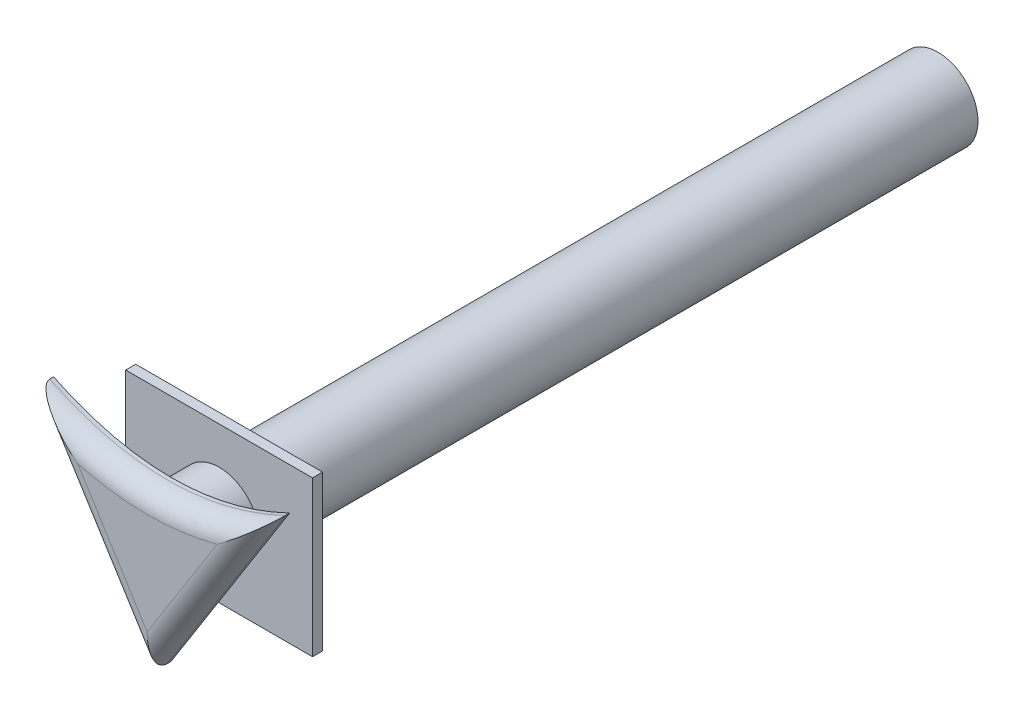
ISO-10303-21;
HEADER;
FILE_DESCRIPTION(('STEP AP214'),'2;1');
FILE_NAME('part.step','',(''),(''),'','','');
FILE_SCHEMA(('AUTOMOTIVE_DESIGN { 1 0 10303 214 1 1 1 1 }'));
ENDSEC;
DATA;
#1=APPLICATION_CONTEXT('core data for automotive mechanical design processes');
#2=APPLICATION_PROTOCOL_DEFINITION('international standard','automotive_design',2000,#1);
#3=PRODUCT_CONTEXT('',#1,'mechanical');
#4=PRODUCT('Part','Part','',(#3));
#5=PRODUCT_RELATED_PRODUCT_CATEGORY('part','',(#4));
#6=PRODUCT_DEFINITION_FORMATION('','',#4);
#7=PRODUCT_DEFINITION_CONTEXT('part definition',#1,'design');
#8=PRODUCT_DEFINITION('design','',#6,#7);
#9=PRODUCT_DEFINITION_SHAPE('','',#8);
#10=(LENGTH_UNIT() NAMED_UNIT(*) SI_UNIT(.MILLI.,.METRE.));
#11=(NAMED_UNIT(*) PLANE_ANGLE_UNIT() SI_UNIT($,.RADIAN.));
#12=(NAMED_UNIT(*) SI_UNIT($,.STERADIAN.) SOLID_ANGLE_UNIT());
#13=UNCERTAINTY_MEASURE_WITH_UNIT(LENGTH_MEASURE(1.E-05),#10,'distance_accuracy_value','');
#14=(GEOMETRIC_REPRESENTATION_CONTEXT(3) GLOBAL_UNCERTAINTY_ASSIGNED_CONTEXT((#13)) GLOBAL_UNIT_ASSIGNED_CONTEXT((#10,
#11,#12)) REPRESENTATION_CONTEXT('',''));
#15=CARTESIAN_POINT('',(0.,0.,0.));
#16=DIRECTION('',(0.,0.,1.));
#17=DIRECTION('',(1.,0.,0.));
#18=AXIS2_PLACEMENT_3D('',#15,#16,#17);
#19=CARTESIAN_POINT('',(30.2979017510264,43.0432393904696,0.3));
#20=DIRECTION('',(-0.847844868377494,-0.530244357976537,0.));
#21=DIRECTION('',(0.530244357976537,-0.847844868377494,0.));
#22=AXIS2_PLACEMENT_3D('',#19,#20,#21);
#23=PLANE('',#22);
#24=DIRECTION('',(0.,0.,1.));
#25=VECTOR('',#24,1.);
#26=CARTESIAN_POINT('',(36.1630126567419,33.6651024823239,0.3));
#27=LINE('',#26,#25);
#28=CARTESIAN_POINT('',(36.1630126567419,33.6651024823239,0.3));
#29=VERTEX_POINT('',#28);
#30=CARTESIAN_POINT('',(36.1630126567419,33.6651024823239,0.5));
#31=VERTEX_POINT('',#30);
#32=EDGE_CURVE('E158',#29,#31,#27,.T.);
#33=ORIENTED_EDGE('',*,*,#32,.T.);
#34=DIRECTION('',(0.530244357976537,-0.847844868377494,0.));
#35=VECTOR('',#34,1.);
#36=CARTESIAN_POINT('',(30.2979017510264,43.0432393904696,0.5));
#37=LINE('',#36,#35);
#38=CARTESIAN_POINT('',(30.2979017496192,43.0432393910986,0.5));
#39=VERTEX_POINT('',#38);
#40=EDGE_CURVE('E287',#31,#39,#37,.F.);
#41=ORIENTED_EDGE('',*,*,#40,.T.);
#42=DIRECTION('',(0.,0.,1.));
#43=VECTOR('',#42,1.);
#44=CARTESIAN_POINT('',(30.2979017496192,43.0432393910986,0.3));
#45=LINE('',#44,#43);
#46=CARTESIAN_POINT('',(30.2979017496192,43.0432393910986,0.3));
#47=VERTEX_POINT('',#46);
#48=EDGE_CURVE('E159',#47,#39,#45,.T.);
#49=ORIENTED_EDGE('',*,*,#48,.F.);
#50=DIRECTION('',(0.530244357976537,-0.847844868377494,0.));
#51=VECTOR('',#50,1.);
#52=CARTESIAN_POINT('',(30.2979017510264,43.0432393904696,0.3));
#53=LINE('',#52,#51);
#54=EDGE_CURVE('E145',#47,#29,#53,.T.);
#55=ORIENTED_EDGE('',*,*,#54,.T.);
#56=EDGE_LOOP('',(#33,#41,#49,#55));
#57=FACE_BOUND('',#56,.T.);
#58=ADVANCED_FACE('F32',(#57),#23,.T.);
#59=CARTESIAN_POINT('',(6066.28827286999,1000035.64074364,0.3));
#60=CARTESIAN_POINT('',(-1053.93647667072,-999957.785750634,0.3));
#61=CARTESIAN_POINT('',(-3813.71006353489,1000046.4110626,0.3));
#62=B_SPLINE_CURVE_WITH_KNOTS('',2,(#59,#60,#61),.UNSPECIFIED.,.F.,.F.,(3,3),(0.,1.),.UNSPECIFIED.);
#63=DIRECTION('',(0.,0.,1.));
#64=VECTOR('',#63,1.);
#65=SURFACE_OF_LINEAR_EXTRUSION('',#62,#64);
#66=ORIENTED_EDGE('',*,*,#48,.T.);
#67=CARTESIAN_POINT('',(45.7335735005879,45.3494086708565,0.5));
#68=CARTESIAN_POINT('',(45.7335735005768,45.3494086708707,1.5));
#69=CARTESIAN_POINT('',(46.3491799059495,44.561354895,1.5));
#70=CARTESIAN_POINT('',(45.7331086395795,45.349045539195,0.5));
#71=CARTESIAN_POINT('',(45.7331086395754,45.3490455392002,1.5));
#72=CARTESIAN_POINT('',(46.3488196658647,44.5610735077939,1.5));
#73=CARTESIAN_POINT('',(45.7327119327311,45.348735662061,0.5));
#74=CARTESIAN_POINT('',(45.7327119327301,45.3487356620624,1.5));
#75=CARTESIAN_POINT('',(46.3484594248833,44.560792121735,1.5));
#76=CARTESIAN_POINT('',(45.7319811215552,45.3481648402711,0.5));
#77=CARTESIAN_POINT('',(45.7319811215563,45.3481648402696,1.5));
#78=CARTESIAN_POINT('',(46.3477389340724,44.5602293609476,1.5));
#79=CARTESIAN_POINT('',(45.7316470172274,45.3479038956151,0.5));
#80=CARTESIAN_POINT('',(45.7316470172278,45.3479038956146,1.5));
#81=CARTESIAN_POINT('',(46.3473786842429,44.559947986219,1.5));
#82=CARTESIAN_POINT('',(45.7306280493234,45.3471080954971,0.5));
#83=CARTESIAN_POINT('',(45.7306280493225,45.3471080954983,1.5));
#84=CARTESIAN_POINT('',(46.3462979108972,44.5591038925802,1.5));
#85=CARTESIAN_POINT('',(45.7299265308262,45.3465602738852,0.5));
#86=CARTESIAN_POINT('',(45.7299265308258,45.3465602738857,1.5));
#87=CARTESIAN_POINT('',(46.3455773635234,44.5585412042167,1.5));
#88=CARTESIAN_POINT('',(45.7278336862121,45.3449261338302,0.5));
#89=CARTESIAN_POINT('',(45.7278336862124,45.3449261338299,1.5));
#90=CARTESIAN_POINT('',(46.3434156334423,44.5568532517864,1.5));
#91=CARTESIAN_POINT('',(45.7264540709661,45.3438491401631,0.5));
#92=CARTESIAN_POINT('',(45.7264540709655,45.3438491401638,1.5));
#93=CARTESIAN_POINT('',(46.3419743627689,44.5557281003746,1.5));
#94=CARTESIAN_POINT('',(45.7223065714428,45.3406121058281,0.5));
#95=CARTESIAN_POINT('',(45.7223065714438,45.3406121058268,1.5));
#96=CARTESIAN_POINT('',(46.3376501935769,44.552353103825,1.5));
#97=CARTESIAN_POINT('',(45.7195300333449,45.3384460117987,0.5));
#98=CARTESIAN_POINT('',(45.719530033352,45.3384460117896,1.5));
#99=CARTESIAN_POINT('',(46.3347669378493,44.5501037163438,1.5));
#100=CARTESIAN_POINT('',(45.7112051237383,45.3319542342932,0.5));
#101=CARTESIAN_POINT('',(45.711205123724,45.3319542343116,1.5));
#102=CARTESIAN_POINT('',(46.3261157453976,44.5433573825314,1.5));
#103=CARTESIAN_POINT('',(45.7056614564164,45.3276350550088,0.5));
#104=CARTESIAN_POINT('',(45.7056614563349,45.3276350551138,1.5));
#105=CARTESIAN_POINT('',(46.3203463828867,44.5388622644265,1.5));
#106=CARTESIAN_POINT('',(45.6890214123043,45.3146817913281,0.5));
#107=CARTESIAN_POINT('',(45.6890214124259,45.3146817911712,1.5));
#108=CARTESIAN_POINT('',(46.303032586957,44.5253842457298,1.5));
#109=CARTESIAN_POINT('',(45.6779159918359,45.3060519799072,0.5));
#110=CARTESIAN_POINT('',(45.6779159926327,45.3060519788805,1.5));
#111=CARTESIAN_POINT('',(46.2914824435459,44.5164086795096,1.5));
#112=CARTESIAN_POINT('',(45.6445833078567,45.280195226233,0.5));
#113=CARTESIAN_POINT('',(45.6445833094798,45.2801952241418,1.5));
#114=CARTESIAN_POINT('',(46.2568091702562,44.4895114976609,1.5));
#115=CARTESIAN_POINT('',(45.6223395843858,45.2630009353633,0.5));
#116=CARTESIAN_POINT('',(45.6223395849609,45.2630009346223,1.5));
#117=CARTESIAN_POINT('',(46.2336631584577,44.4716193684841,1.5));
#118=CARTESIAN_POINT('',(45.5555284179161,45.2115388847596,0.5));
#119=CARTESIAN_POINT('',(45.5555284167663,45.2115388862411,1.5));
#120=CARTESIAN_POINT('',(46.1641332800053,44.4180621158519,1.5));
#121=CARTESIAN_POINT('',(45.5108810113853,45.1773919724412,0.5));
#122=CARTESIAN_POINT('',(45.5108810109776,45.1773919729669,1.5));
#123=CARTESIAN_POINT('',(46.1176576041264,44.382516153726,1.5));
#124=CARTESIAN_POINT('',(45.3766300230627,45.0754535462892,0.5));
#125=CARTESIAN_POINT('',(45.3766300238781,45.0754535452379,1.5));
#126=CARTESIAN_POINT('',(45.9778634161705,44.2763666219551,1.5));
#127=CARTESIAN_POINT('',(45.2867150214892,45.0081622715448,0.5));
#128=CARTESIAN_POINT('',(45.2867150217829,45.0081622711627,1.5));
#129=CARTESIAN_POINT('',(45.8841749869004,44.2062492523865,1.5));
#130=CARTESIAN_POINT('',(45.0156853457064,44.8083431547999,0.5));
#131=CARTESIAN_POINT('',(45.0156853451199,44.808343155563,1.5));
#132=CARTESIAN_POINT('',(45.6015874931887,43.9979047657089,1.5));
#133=CARTESIAN_POINT('',(44.833311307029,44.6778898203783,0.5));
#134=CARTESIAN_POINT('',(44.8333113067696,44.6778898207543,1.5));
#135=CARTESIAN_POINT('',(45.4111925390576,43.861705864209,1.5));
#136=CARTESIAN_POINT('',(44.2805184153718,44.2950683525777,0.5));
#137=CARTESIAN_POINT('',(44.2805184158934,44.2950683518216,1.5));
#138=CARTESIAN_POINT('',(44.8332805985207,43.4614793439334,1.5));
#139=CARTESIAN_POINT('',(43.9049586346634,44.0516554081136,0.5));
#140=CARTESIAN_POINT('',(43.9049586354369,44.0516554066426,1.5));
#141=CARTESIAN_POINT('',(44.4395872728254,43.2062552861195,1.5));
#142=CARTESIAN_POINT('',(43.1345730125814,43.5891282150532,0.5));
#143=CARTESIAN_POINT('',(43.1345730126051,43.5891282151997,1.5));
#144=CARTESIAN_POINT('',(43.629481576213,42.7198699851167,1.5));
#145=CARTESIAN_POINT('',(42.7395428036684,43.3704327315915,0.5));
#146=CARTESIAN_POINT('',(42.7395428026717,43.3704327341162,1.5));
#147=CARTESIAN_POINT('',(43.2128171675268,42.4891266245356,1.5));
#148=CARTESIAN_POINT('',(41.9363161818128,42.9660449107167,0.5));
#149=CARTESIAN_POINT('',(41.9363161828066,42.9660449081982,1.5));
#150=CARTESIAN_POINT('',(42.3627461303794,42.061144940266,1.5));
#151=CARTESIAN_POINT('',(41.5281264595165,42.7803361051633,0.5));
#152=CARTESIAN_POINT('',(41.528126463519,42.7803360952283,1.5));
#153=CARTESIAN_POINT('',(41.9293479883117,41.8638899001863,1.5));
#154=CARTESIAN_POINT('',(40.7178576457224,42.4535518139551,0.5));
#155=CARTESIAN_POINT('',(40.717857649617,42.453551804317,1.5));
#156=CARTESIAN_POINT('',(41.0661620244384,41.5157561901519,1.5));
#157=CARTESIAN_POINT('',(40.316290749012,42.3108807737344,0.5));
#158=CARTESIAN_POINT('',(40.3162907500517,42.310880771163,1.5));
#159=CARTESIAN_POINT('',(40.6370437556781,41.3632278511785,1.5));
#160=CARTESIAN_POINT('',(39.5040297166957,42.0633373044249,0.5));
#161=CARTESIAN_POINT('',(39.5040297156429,42.0633373070392,1.5));
#162=CARTESIAN_POINT('',(39.766554159097,41.0979331402665,1.5));
#163=CARTESIAN_POINT('',(39.0933351531859,41.958466651399,0.5));
#164=CARTESIAN_POINT('',(39.0933351528955,41.9584666521319,1.5));
#165=CARTESIAN_POINT('',(39.3251822565845,40.9851686366494,1.5));
#166=CARTESIAN_POINT('',(38.2687423306789,41.7902676109707,0.5));
#167=CARTESIAN_POINT('',(38.2687423309478,41.7902676103375,1.5));
#168=CARTESIAN_POINT('',(38.4370379252583,40.8040029399922,1.5));
#169=CARTESIAN_POINT('',(37.8548960969657,41.7266131436139,0.5));
#170=CARTESIAN_POINT('',(37.8548960970392,41.7266131434769,1.5));
#171=CARTESIAN_POINT('',(37.9903370903083,40.7352535731856,1.5));
#172=CARTESIAN_POINT('',(37.023891067508,41.6415196539969,0.5));
#173=CARTESIAN_POINT('',(37.02389106743,41.6415196541787,1.5));
#174=CARTESIAN_POINT('',(37.0922829947754,40.6432933024116,1.5));
#175=CARTESIAN_POINT('',(36.606732849846,41.6200734204598,0.5));
#176=CARTESIAN_POINT('',(36.606732849812,41.6200734204645,1.5));
#177=CARTESIAN_POINT('',(36.6409305421697,40.6200746195294,1.5));
#178=CARTESIAN_POINT('',(35.8197293857221,41.6200650649362,0.5));
#179=CARTESIAN_POINT('',(35.8197293857523,41.6200650649173,1.5));
#180=CARTESIAN_POINT('',(35.7894048282363,40.6200640016286,1.5));
#181=CARTESIAN_POINT('',(35.4498755249821,41.636921948999,0.5));
#182=CARTESIAN_POINT('',(35.4498755250345,41.6369219490986,1.5));
#183=CARTESIAN_POINT('',(35.3892236052004,40.6383126489799,1.5));
#184=CARTESIAN_POINT('',(34.7125345666675,41.7039136249315,0.5));
#185=CARTESIAN_POINT('',(34.7125345666104,41.7039136247798,1.5));
#186=CARTESIAN_POINT('',(34.5921542668251,40.7107329421308,1.5));
#187=CARTESIAN_POINT('',(34.3450473635447,41.7540469222138,0.5));
#188=CARTESIAN_POINT('',(34.3450473633557,41.7540469216925,1.5));
#189=CARTESIAN_POINT('',(34.1952660043952,40.764902974546,1.5));
#190=CARTESIAN_POINT('',(33.6120148826078,41.8868388884535,0.5));
#191=CARTESIAN_POINT('',(33.6120148827965,41.8868388889688,1.5));
#192=CARTESIAN_POINT('',(33.4049436308872,40.9080762644321,1.5));
#193=CARTESIAN_POINT('',(33.2465020936867,41.9697267421534,0.5));
#194=CARTESIAN_POINT('',(33.2465020943894,41.9697267440876,1.5));
#195=CARTESIAN_POINT('',(33.0115542750572,40.9973249442197,1.5));
#196=CARTESIAN_POINT('',(32.522021798467,42.1660626895427,0.5));
#197=CARTESIAN_POINT('',(32.5220217977532,42.1660626875674,1.5));
#198=CARTESIAN_POINT('',(32.2336198307675,41.2081523362124,1.5));
#199=CARTESIAN_POINT('',(32.1630542852425,42.2795107508928,0.5));
#200=CARTESIAN_POINT('',(32.163054282598,42.279510743589,1.5));
#201=CARTESIAN_POINT('',(31.8490747329491,41.3297310142052,1.5));
#202=CARTESIAN_POINT('',(31.3454347711054,42.5732886988452,0.5));
#203=CARTESIAN_POINT('',(31.3454347679063,42.573288689876,1.5));
#204=CARTESIAN_POINT('',(30.9755237325729,41.643612215028,1.5));
#205=CARTESIAN_POINT('',(30.8895626815628,42.7634677778477,0.5));
#206=CARTESIAN_POINT('',(30.88956268092,42.7634677757579,1.5));
#207=CARTESIAN_POINT('',(30.4902013047443,41.8461813415862,1.5));
#208=CARTESIAN_POINT('',(29.9933192111917,43.185975468697,0.5));
#209=CARTESIAN_POINT('',(29.9933192118394,43.1859754707977,1.5));
#210=CARTESIAN_POINT('',(29.5394962065659,42.294373733884,1.5));
#211=CARTESIAN_POINT('',(29.5529642103806,43.4183471166328,0.5));
#212=CARTESIAN_POINT('',(29.5529642097585,43.4183471160345,1.5));
#213=CARTESIAN_POINT('',(29.074134500715,42.5400409506035,1.5));
#214=CARTESIAN_POINT('',(28.6949148686064,43.9158733213685,0.5));
#215=CARTESIAN_POINT('',(28.6949148683932,43.9158733205331,1.5));
#216=CARTESIAN_POINT('',(28.1704596110674,43.0640294158496,1.5));
#217=CARTESIAN_POINT('',(28.2770002642343,44.1805621010411,0.5));
#218=CARTESIAN_POINT('',(28.2770002656615,44.1805621026007,1.5));
#219=CARTESIAN_POINT('',(27.731873316164,43.3418843138641,1.5));
#220=CARTESIAN_POINT('',(27.4589207402657,44.739171406259,0.5));
#221=CARTESIAN_POINT('',(27.4589207388387,44.7391714046983,1.5));
#222=CARTESIAN_POINT('',(26.8759382148646,43.9263743654658,1.5));
#223=CARTESIAN_POINT('',(27.0587120601277,45.0330132814566,0.5));
#224=CARTESIAN_POINT('',(27.0587120542222,45.0330132744011,1.5));
#225=CARTESIAN_POINT('',(26.4585366246044,44.2329319643074,1.5));
#226=CARTESIAN_POINT('',(26.6668313159995,45.3392091757773,0.5));
#227=CARTESIAN_POINT('',(26.6668312980907,45.3392091528712,1.5));
#228=CARTESIAN_POINT('',(26.0509023544704,44.5514074415181,1.5));
#229=(BOUNDED_SURFACE() B_SPLINE_SURFACE(3,2,((#67,#68,#69),(#70,#71,#72),(#73,#74,#75),(#76,
#77,#78),(#79,#80,#81),(#82,#83,#84),(#85,#86,#87),(#88,#89,#90),(#91,#92,#93),(#94,#95,#96),
(#97,#98,#99),(#100,#101,#102),(#103,#104,#105),(#106,#107,#108),(#109,#110,#111),(#112,#113,
#114),(#115,#116,#117),(#118,#119,#120),(#121,#122,#123),(#124,#125,#126),(#127,#128,#129),
(#130,#131,#132),(#133,#134,#135),(#136,#137,#138),(#139,#140,#141),(#142,#143,#144),(#145,#146,
#147),(#148,#149,#150),(#151,#152,#153),(#154,#155,#156),(#157,#158,#159),(#160,#161,#162),
(#163,#164,#165),(#166,#167,#168),(#169,#170,#171),(#172,#173,#174),(#175,#176,#177),(#178,#179,
#180),(#181,#182,#183),(#184,#185,#186),(#187,#188,#189),(#190,#191,#192),(#193,#194,#195),
(#196,#197,#198),(#199,#200,#201),(#202,#203,#204),(#205,#206,#207),(#208,#209,#210),(#211,#212,
#213),(#214,#215,#216),(#217,#218,#219),(#220,#221,#222),(#223,#224,#225),(#226,#227,#228)),
.UNSPECIFIED.,.F.,.F.,.F.) B_SPLINE_SURFACE_WITH_KNOTS((4,2,2,2,2,2,2,2,2,2,2,2,2,2,2,2,2,2,2,2,
2,2,2,2,2,2,4),(3,3),(0.,0.00137133697820587,0.00274267395243674,0.00548534789970985,
0.0109706957695298,0.0219413913672367,0.0438827805899432,0.087765552962445,0.175530949758712,
0.351061872145982,0.702113221120698,1.40431612564923,2.81082102650417,4.23840199130549,
5.66526824068247,7.02979426272532,8.39438438909092,9.74804226853787,11.1014688554522,
12.3016402280318,13.5017576993861,14.7104254990754,15.9190920197325,17.4942700503849,
19.0710638691238,20.6273460272763,22.1795382110022),(0.,1.),
.UNSPECIFIED.) GEOMETRIC_REPRESENTATION_ITEM() RATIONAL_B_SPLINE_SURFACE(((1.,0.707106781186548,
1.),(1.,0.707106781186548,1.),(1.,0.707106781186548,1.),(1.,0.707106781186548,1.),(1.,
0.707106781186548,1.),(1.,0.707106781186548,1.),(1.,0.707106781186548,1.),(1.,0.707106781186548,
1.),(1.,0.707106781186548,1.),(1.,0.707106781186548,1.),(1.,0.707106781186548,1.),(1.,
0.707106781186548,1.),(1.,0.707106781186548,1.),(1.,0.707106781186548,1.),(1.,0.707106781186548,
1.),(1.,0.707106781186548,1.),(1.,0.707106781186548,1.),(1.,0.707106781186548,1.),(1.,
0.707106781186548,1.),(1.,0.707106781186548,1.),(1.,0.707106781186548,1.),(1.,0.707106781186548,
1.),(1.,0.707106781186548,1.),(1.,0.707106781186548,1.),(1.,0.707106781186548,1.),(1.,
0.707106781186548,1.),(1.,0.707106781186548,1.),(1.,0.707106781186548,1.),(1.,0.707106781186548,
1.),(1.,0.707106781186548,1.),(1.,0.707106781186548,1.),(1.,0.707106781186548,1.),(1.,
0.707106781186548,1.),(1.,0.707106781186548,1.),(1.,0.707106781186548,1.),(1.,0.707106781186548,
1.),(1.,0.707106781186548,1.),(1.,0.707106781186548,1.),(1.,0.707106781186548,1.),(1.,
0.707106781186548,1.),(1.,0.707106781186548,1.),(1.,0.707106781186548,1.),(1.,0.707106781186548,
1.),(1.,0.707106781186548,1.),(1.,0.707106781186548,1.),(1.,0.707106781186548,1.),(1.,
0.707106781186548,1.),(1.,0.707106781186548,1.),(1.,0.707106781186548,1.),(1.,0.707106781186548,
1.),(1.,0.707106781186548,1.),(1.,0.707106781186548,1.),(1.,0.707106781186548,1.),(1.,
0.707106781186548,1.))) REPRESENTATION_ITEM('') SURFACE());
#230=CARTESIAN_POINT('',(26.6668313159995,45.3392091757773,0.5));
#231=CARTESIAN_POINT('',(27.0587120601277,45.0330132814566,0.5));
#232=CARTESIAN_POINT('',(27.4589207402657,44.739171406259,0.5));
#233=CARTESIAN_POINT('',(28.2770002642343,44.1805621010411,0.5));
#234=CARTESIAN_POINT('',(28.6949148686064,43.9158733213685,0.5));
#235=CARTESIAN_POINT('',(29.5529642103806,43.4183471166328,0.5));
#236=CARTESIAN_POINT('',(29.9933192111917,43.185975468697,0.5));
#237=CARTESIAN_POINT('',(30.8895626815628,42.7634677778477,0.5));
#238=CARTESIAN_POINT('',(31.3454347711054,42.5732886988452,0.5));
#239=CARTESIAN_POINT('',(32.1630542852425,42.2795107508928,0.5));
#240=CARTESIAN_POINT('',(32.522021798467,42.1660626895427,0.5));
#241=CARTESIAN_POINT('',(33.2465020936867,41.9697267421533,0.5));
#242=CARTESIAN_POINT('',(33.6120148826078,41.8868388884535,0.5));
#243=CARTESIAN_POINT('',(34.3450473635447,41.7540469222138,0.5));
#244=CARTESIAN_POINT('',(34.7125345666675,41.7039136249315,0.5));
#245=CARTESIAN_POINT('',(35.4498755249821,41.636921948999,0.5));
#246=CARTESIAN_POINT('',(35.8197293857221,41.6200650649362,0.5));
#247=CARTESIAN_POINT('',(36.606732849846,41.6200734204598,0.5));
#248=CARTESIAN_POINT('',(37.023891067508,41.6415196539969,0.5));
#249=CARTESIAN_POINT('',(37.8548960969657,41.7266131436139,0.5));
#250=CARTESIAN_POINT('',(38.2687423306789,41.7902676109706,0.5));
#251=CARTESIAN_POINT('',(39.0933351531859,41.958466651399,0.5));
#252=CARTESIAN_POINT('',(39.5040297166957,42.0633373044249,0.5));
#253=CARTESIAN_POINT('',(40.316290749012,42.3108807737344,0.5));
#254=CARTESIAN_POINT('',(40.7178576457224,42.4535518139551,0.5));
#255=CARTESIAN_POINT('',(41.5281264595165,42.7803361051633,0.5));
#256=CARTESIAN_POINT('',(41.9363161818128,42.9660449107167,0.5));
#257=CARTESIAN_POINT('',(42.7395428036684,43.3704327315915,0.5));
#258=CARTESIAN_POINT('',(43.1345730125814,43.5891282150532,0.5));
#259=CARTESIAN_POINT('',(43.9049586346634,44.0516554081136,0.5));
#260=CARTESIAN_POINT('',(44.2805184153718,44.2950683525777,0.5));
#261=CARTESIAN_POINT('',(44.833311307029,44.6778898203783,0.5));
#262=CARTESIAN_POINT('',(45.0156853457064,44.8083431547999,0.5));
#263=CARTESIAN_POINT('',(45.2867150214892,45.0081622715448,0.5));
#264=CARTESIAN_POINT('',(45.3766300230627,45.0754535462892,0.5));
#265=CARTESIAN_POINT('',(45.5108810113853,45.1773919724412,0.5));
#266=CARTESIAN_POINT('',(45.5555284179161,45.2115388847596,0.5));
#267=CARTESIAN_POINT('',(45.6223395843858,45.2630009353633,0.5));
#268=CARTESIAN_POINT('',(45.6445833078567,45.280195226233,0.5));
#269=CARTESIAN_POINT('',(45.6779159918359,45.3060519799072,0.5));
#270=CARTESIAN_POINT('',(45.6890214123043,45.3146817913281,0.5));
#271=CARTESIAN_POINT('',(45.7056614564164,45.3276350550088,0.5));
#272=CARTESIAN_POINT('',(45.7112051237383,45.3319542342932,0.5));
#273=CARTESIAN_POINT('',(45.7195300333449,45.3384460117987,0.5));
#274=CARTESIAN_POINT('',(45.7223065714428,45.3406121058281,0.5));
#275=CARTESIAN_POINT('',(45.7264540709661,45.3438491401631,0.5));
#276=CARTESIAN_POINT('',(45.7278336862121,45.3449261338302,0.5));
#277=CARTESIAN_POINT('',(45.7299265308262,45.3465602738852,0.5));
#278=CARTESIAN_POINT('',(45.7306280493234,45.3471080954971,0.5));
#279=CARTESIAN_POINT('',(45.7316470172274,45.3479038956151,0.5));
#280=CARTESIAN_POINT('',(45.7319811215552,45.3481648402711,0.5));
#281=CARTESIAN_POINT('',(45.7327119327311,45.348735662061,0.5));
#282=CARTESIAN_POINT('',(45.7331086395795,45.349045539195,0.5));
#283=CARTESIAN_POINT('',(45.7335735005879,45.3494086708565,0.5));
#284=B_SPLINE_CURVE_WITH_KNOTS('',3,(#230,#231,#232,#233,#234,#235,#236,#237,#238,#239,#240,
#241,#242,#243,#244,#245,#246,#247,#248,#249,#250,#251,#252,#253,#254,#255,#256,#257,#258,#259,
#260,#261,#262,#263,#264,#265,#266,#267,#268,#269,#270,#271,#272,#273,#274,#275,#276,#277,#278,
#279,#280,#281,#282,#283),.UNSPECIFIED.,.F.,.F.,(4,2,2,2,2,2,2,2,2,2,2,2,2,2,2,2,2,2,2,2,2,2,2,
2,2,2,4),(0.,1.55219218372584,3.10847434187844,4.68526816061731,6.26044619126973,
7.46911271192677,8.67778051161605,9.87789798297044,11.07806935555,12.4314959424643,
13.7851538219113,15.1497439482769,16.5142699703197,17.9411362196967,19.368717184498,
20.775222085353,21.4774249898815,21.8284763388562,22.0040072612435,22.0917726580397,
22.1356554304122,22.1575968196349,22.1685675152327,22.1740528631025,22.1767955370498,
22.178166874024,22.1795382110022),.UNSPECIFIED.);
#285=CARTESIAN_POINT('',(42.0844317951162,43.0432393904696,0.5));
#286=VERTEX_POINT('',#285);
#287=EDGE_CURVE('E42',#39,#286,#284,.T.);
#288=ORIENTED_EDGE('',*,*,#287,.T.);
#289=DIRECTION('',(0.,0.,1.));
#290=VECTOR('',#289,1.);
#291=CARTESIAN_POINT('',(42.0844317951162,43.0432393904696,0.3));
#292=LINE('',#291,#290);
#293=CARTESIAN_POINT('',(42.0844317951162,43.0432393904696,0.3));
#294=VERTEX_POINT('',#293);
#295=EDGE_CURVE('E282',#294,#286,#292,.T.);
#296=ORIENTED_EDGE('',*,*,#295,.F.);
#297=EDGE_CURVE('E152',#294,#47,#62,.T.);
#298=ORIENTED_EDGE('',*,*,#297,.T.);
#299=EDGE_LOOP('',(#66,#288,#296,#298));
#300=FACE_BOUND('',#299,.T.);
#301=ADVANCED_FACE('F165',(#300),#65,.T.);
#302=CARTESIAN_POINT('',(36.1630126567419,33.6651024823239,0.3));
#303=DIRECTION('',(0.845554626071817,-0.53388891571988,0.));
#304=DIRECTION('',(0.53388891571988,0.845554626071817,0.));
#305=AXIS2_PLACEMENT_3D('',#302,#303,#304);
#306=PLANE('',#305);
#307=ORIENTED_EDGE('',*,*,#295,.T.);
#308=DIRECTION('',(0.53388891571988,0.845554626071817,0.));
#309=VECTOR('',#308,1.);
#310=CARTESIAN_POINT('',(36.1630126567419,33.6651024823239,0.5));
#311=LINE('',#310,#309);
#312=EDGE_CURVE('E217',#286,#31,#311,.F.);
#313=ORIENTED_EDGE('',*,*,#312,.T.);
#314=ORIENTED_EDGE('',*,*,#32,.F.);
#315=DIRECTION('',(0.53388891571988,0.845554626071817,0.));
#316=VECTOR('',#315,1.);
#317=CARTESIAN_POINT('',(36.1630126567419,33.6651024823239,0.3));
#318=LINE('',#317,#316);
#319=EDGE_CURVE('E148',#29,#294,#318,.T.);
#320=ORIENTED_EDGE('',*,*,#319,.T.);
#321=EDGE_LOOP('',(#307,#313,#314,#320));
#322=FACE_BOUND('',#321,.T.);
#323=ADVANCED_FACE('F170',(#322),#306,.T.);
#324=CARTESIAN_POINT('',(36.1763139984144,41.6200762419408,0.3));
#325=DIRECTION('',(0.,0.,1.));
#326=DIRECTION('',(1.,0.,0.));
#327=AXIS2_PLACEMENT_3D('',#324,#325,#326);
#328=PLANE('',#327);
#329=CARTESIAN_POINT('',(36.1630126567419,38.8669616348161,0.300000000000002));
#330=DIRECTION('',(0.,0.,1.));
#331=DIRECTION('',(1.,0.,0.));
#332=AXIS2_PLACEMENT_3D('',#329,#330,#331);
#333=CIRCLE('',#332,2.);
#334=CARTESIAN_POINT('',(38.1630126567419,38.8669616348161,0.300000000000002));
#335=VERTEX_POINT('',#334);
#336=EDGE_CURVE('E235',#335,#335,#333,.F.);
#337=ORIENTED_EDGE('',*,*,#336,.F.);
#338=EDGE_LOOP('',(#337));
#339=FACE_BOUND('',#338,.T.);
#340=ORIENTED_EDGE('',*,*,#54,.F.);
#341=ORIENTED_EDGE('',*,*,#297,.F.);
#342=ORIENTED_EDGE('',*,*,#319,.F.);
#343=EDGE_LOOP('',(#340,#341,#342));
#344=FACE_BOUND('',#343,.T.);
#345=ADVANCED_FACE('F171',(#339,#344),#328,.F.);
#346=CARTESIAN_POINT('',(36.1763139984144,41.6200762419408,1.5));
#347=DIRECTION('',(0.,0.,1.));
#348=DIRECTION('',(1.,0.,0.));
#349=AXIS2_PLACEMENT_3D('',#346,#347,#348);
#350=PLANE('',#349);
#351=CARTESIAN_POINT('',(46.3491799059495,44.561354895,1.5));
#352=CARTESIAN_POINT('',(46.3488196658647,44.5610735077939,1.5));
#353=CARTESIAN_POINT('',(46.3484594248833,44.560792121735,1.5));
#354=CARTESIAN_POINT('',(46.3477389340724,44.5602293609476,1.5));
#355=CARTESIAN_POINT('',(46.3473786842429,44.559947986219,1.5));
#356=CARTESIAN_POINT('',(46.3462979108972,44.5591038925802,1.5));
#357=CARTESIAN_POINT('',(46.3455773635234,44.5585412042167,1.5));
#358=CARTESIAN_POINT('',(46.3434156334423,44.5568532517864,1.5));
#359=CARTESIAN_POINT('',(46.3419743627689,44.5557281003746,1.5));
#360=CARTESIAN_POINT('',(46.3376501935769,44.552353103825,1.5));
#361=CARTESIAN_POINT('',(46.3347669378493,44.5501037163438,1.5));
#362=CARTESIAN_POINT('',(46.3261157453976,44.5433573825314,1.5));
#363=CARTESIAN_POINT('',(46.3203463828867,44.5388622644265,1.5));
#364=CARTESIAN_POINT('',(46.303032586957,44.5253842457298,1.5));
#365=CARTESIAN_POINT('',(46.2914824435459,44.5164086795096,1.5));
#366=CARTESIAN_POINT('',(46.2568091702562,44.4895114976609,1.5));
#367=CARTESIAN_POINT('',(46.2336631584577,44.4716193684841,1.5));
#368=CARTESIAN_POINT('',(46.1641332800053,44.4180621158519,1.5));
#369=CARTESIAN_POINT('',(46.1176576041264,44.382516153726,1.5));
#370=CARTESIAN_POINT('',(45.9778634161705,44.2763666219551,1.5));
#371=CARTESIAN_POINT('',(45.8841749869004,44.2062492523865,1.5));
#372=CARTESIAN_POINT('',(45.6015874931887,43.997904765709,1.5));
#373=CARTESIAN_POINT('',(45.4111925390576,43.861705864209,1.5));
#374=CARTESIAN_POINT('',(44.8332805985207,43.4614793439334,1.5));
#375=CARTESIAN_POINT('',(44.4395872728254,43.2062552861195,1.5));
#376=CARTESIAN_POINT('',(43.629481576213,42.7198699851167,1.5));
#377=CARTESIAN_POINT('',(43.2128171675268,42.4891266245356,1.5));
#378=CARTESIAN_POINT('',(42.3627461303794,42.061144940266,1.5));
#379=CARTESIAN_POINT('',(41.9293479883117,41.8638899001863,1.5));
#380=CARTESIAN_POINT('',(41.0661620244384,41.5157561901519,1.5));
#381=CARTESIAN_POINT('',(40.6370437556781,41.3632278511785,1.5));
#382=CARTESIAN_POINT('',(39.766554159097,41.0979331402665,1.5));
#383=CARTESIAN_POINT('',(39.3251822565845,40.9851686366494,1.5));
#384=CARTESIAN_POINT('',(38.4370379252583,40.8040029399922,1.5));
#385=CARTESIAN_POINT('',(37.9903370903083,40.7352535731856,1.5));
#386=CARTESIAN_POINT('',(37.0922829947754,40.6432933024116,1.5));
#387=CARTESIAN_POINT('',(36.6409305421697,40.6200746195294,1.5));
#388=CARTESIAN_POINT('',(35.7894048282363,40.6200640016286,1.5));
#389=CARTESIAN_POINT('',(35.3892236052004,40.6383126489799,1.5));
#390=CARTESIAN_POINT('',(34.5921542668251,40.7107329421308,1.5));
#391=CARTESIAN_POINT('',(34.1952660043952,40.764902974546,1.5));
#392=CARTESIAN_POINT('',(33.4049436308872,40.9080762644321,1.5));
#393=CARTESIAN_POINT('',(33.0115542750572,40.9973249442197,1.5));
#394=CARTESIAN_POINT('',(32.2336198307675,41.2081523362124,1.5));
#395=CARTESIAN_POINT('',(31.8490747329491,41.3297310142052,1.5));
#396=CARTESIAN_POINT('',(30.9755237325729,41.643612215028,1.5));
#397=CARTESIAN_POINT('',(30.4902013047443,41.8461813415862,1.5));
#398=CARTESIAN_POINT('',(29.5394962065659,42.294373733884,1.5));
#399=CARTESIAN_POINT('',(29.074134500715,42.5400409506035,1.5));
#400=CARTESIAN_POINT('',(28.1704596110674,43.0640294158496,1.5));
#401=CARTESIAN_POINT('',(27.731873316164,43.3418843138641,1.5));
#402=CARTESIAN_POINT('',(26.8759382148646,43.9263743654658,1.5));
#403=CARTESIAN_POINT('',(26.4585366246044,44.2329319643074,1.5));
#404=CARTESIAN_POINT('',(26.0509023544704,44.5514074415181,1.5));
#405=B_SPLINE_CURVE_WITH_KNOTS('',3,(#351,#352,#353,#354,#355,#356,#357,#358,#359,#360,#361,
#362,#363,#364,#365,#366,#367,#368,#369,#370,#371,#372,#373,#374,#375,#376,#377,#378,#379,#380,
#381,#382,#383,#384,#385,#386,#387,#388,#389,#390,#391,#392,#393,#394,#395,#396,#397,#398,#399,
#400,#401,#402,#403,#404),.UNSPECIFIED.,.F.,.F.,(4,2,2,2,2,2,2,2,2,2,2,2,2,2,2,2,2,2,2,2,2,2,2,
2,2,2,4),(0.,0.00137133697820587,0.00274267395243674,0.00548534789970985,0.0109706957695298,
0.0219413913672367,0.0438827805899432,0.087765552962445,0.175530949758712,0.351061872145982,
0.702113221120698,1.40431612564923,2.81082102650417,4.23840199130549,5.66526824068247,
7.02979426272532,8.39438438909092,9.74804226853787,11.1014688554522,12.3016402280318,
13.5017576993861,14.7104254990754,15.9190920197325,17.4942700503849,19.0710638691238,
20.6273460272763,22.1795382110022),.UNSPECIFIED.);
#406=CARTESIAN_POINT('',(39.6600772531557,41.076680117026,1.5));
#407=VERTEX_POINT('',#406);
#408=CARTESIAN_POINT('',(32.7047163642808,41.080737756421,1.5));
#409=VERTEX_POINT('',#408);
#410=EDGE_CURVE('E226',#407,#409,#405,.T.);
#411=ORIENTED_EDGE('',*,*,#410,.T.);
#412=DIRECTION('',(0.530244357976537,-0.847844868377494,0.));
#413=VECTOR('',#412,1.);
#414=CARTESIAN_POINT('',(33.4383198747856,39.9077276857652,1.5));
#415=LINE('',#414,#413);
#416=CARTESIAN_POINT('',(36.1670576459812,35.5445576083226,1.5));
#417=VERTEX_POINT('',#416);
#418=EDGE_CURVE('E290',#409,#417,#415,.T.);
#419=ORIENTED_EDGE('',*,*,#418,.T.);
#420=DIRECTION('',(0.53388891571988,0.845554626071817,0.));
#421=VECTOR('',#420,1.);
#422=CARTESIAN_POINT('',(38.9123810534715,39.8925049788663,1.5));
#423=LINE('',#422,#421);
#424=EDGE_CURVE('E233',#417,#407,#423,.T.);
#425=ORIENTED_EDGE('',*,*,#424,.T.);
#426=EDGE_LOOP('',(#411,#419,#425));
#427=FACE_BOUND('',#426,.T.);
#428=ADVANCED_FACE('F238',(#427),#350,.T.);
#429=CARTESIAN_POINT('',(36.1630126567419,38.8669616348161,-38.));
#430=DIRECTION('',(0.,0.,1.));
#431=DIRECTION('',(1.,0.,0.));
#432=AXIS2_PLACEMENT_3D('',#429,#430,#431);
#433=CYLINDRICAL_SURFACE('',#432,2.);
#434=CARTESIAN_POINT('',(36.1630126567419,38.8669616348161,-2.1));
#435=DIRECTION('',(0.,0.,1.));
#436=DIRECTION('',(1.,0.,0.));
#437=AXIS2_PLACEMENT_3D('',#434,#435,#436);
#438=CIRCLE('',#437,2.);
#439=CARTESIAN_POINT('',(38.1630126567419,38.8669616348161,-2.1));
#440=VERTEX_POINT('',#439);
#441=EDGE_CURVE('E11',#440,#440,#438,.F.);
#442=ORIENTED_EDGE('',*,*,#441,.F.);
#443=EDGE_LOOP('',(#442));
#444=FACE_BOUND('',#443,.T.);
#445=ORIENTED_EDGE('',*,*,#336,.T.);
#446=EDGE_LOOP('',(#445));
#447=FACE_BOUND('',#446,.T.);
#448=ADVANCED_FACE('F223',(#444,#447),#433,.T.);
#449=CARTESIAN_POINT('',(30.2979017499836,43.0432393913265,0.5));
#450=CARTESIAN_POINT('',(30.2978526406091,43.0432828251952,0.518931265778231));
#451=CARTESIAN_POINT('',(30.2993448792003,43.0419439321482,0.537758313169133));
#452=CARTESIAN_POINT('',(30.3049138876788,43.0369517479268,0.574410919012703));
#453=CARTESIAN_POINT('',(30.3089487551757,43.0333359802146,0.5922477069349));
#454=CARTESIAN_POINT('',(30.3204245763079,43.0230580672936,0.631145027660538));
#455=CARTESIAN_POINT('',(30.3284699601698,43.0158557756876,0.651875361035961));
#456=CARTESIAN_POINT('',(30.3469236408719,42.9993579404009,0.691471439876872));
#457=CARTESIAN_POINT('',(30.3573476383414,42.9900484913551,0.710323542963957));
#458=CARTESIAN_POINT('',(30.3888845790406,42.9619237327307,0.760788149560394));
#459=CARTESIAN_POINT('',(30.4118106919842,42.9415217255634,0.790351394334689));
#460=CARTESIAN_POINT('',(30.4604121784712,42.8984038784176,0.845078068368101));
#461=CARTESIAN_POINT('',(30.4860930287362,42.8756834336656,0.87023246085186));
#462=CARTESIAN_POINT('',(30.5544660827003,42.8153910861967,0.930946979581448));
#463=CARTESIAN_POINT('',(30.5984015364771,42.7768343575566,0.964103583002894));
#464=CARTESIAN_POINT('',(30.6885606331157,42.698146007407,1.02508443606719));
#465=CARTESIAN_POINT('',(30.7347893948772,42.6580109083477,1.05289601298357));
#466=CARTESIAN_POINT('',(30.8289822518781,42.5767002908425,1.10467713524935));
#467=CARTESIAN_POINT('',(30.8769546168585,42.5355202039046,1.12862428756685));
#468=CARTESIAN_POINT('',(30.9739178790052,42.4527677943155,1.1733171772478));
#469=CARTESIAN_POINT('',(31.0229076634445,42.4111959247992,1.19406622259573));
#470=CARTESIAN_POINT('',(31.136404626819,42.3154702043439,1.23871820851032));
#471=CARTESIAN_POINT('',(31.2012012051454,42.2612446692842,1.26172900349172));
#472=CARTESIAN_POINT('',(31.3319244527995,42.1527114495213,1.30406946303224));
#473=CARTESIAN_POINT('',(31.3978513397332,42.0984037508775,1.32339840989067));
#474=CARTESIAN_POINT('',(31.5307429721774,41.9898253045136,1.35882947520079));
#475=CARTESIAN_POINT('',(31.5977089617214,41.935554697895,1.37492734251818));
#476=CARTESIAN_POINT('',(31.7324779507431,41.8272400907928,1.40411526997018));
#477=CARTESIAN_POINT('',(31.8002810274778,41.7731961118514,1.41720505026035));
#478=CARTESIAN_POINT('',(32.0042515629152,41.6119851154958,1.45209046557086));
#479=CARTESIAN_POINT('',(32.1415328047146,41.5052873361377,1.46964605502642));
#480=CARTESIAN_POINT('',(32.4184501599427,41.2937504604082,1.49350719846821));
#481=CARTESIAN_POINT('',(32.5580855164808,41.1889107880496,1.49981630130641));
#482=CARTESIAN_POINT('',(32.7006129915144,41.0837637753848,1.49999867316769));
#483=CARTESIAN_POINT('',(32.7026645887963,41.0822506368413,1.49999999094226));
#484=CARTESIAN_POINT('',(32.7047163642493,41.0807377564133,1.5));
#485=B_SPLINE_CURVE_WITH_KNOTS('',3,(#449,#450,#451,#452,#453,#454,#455,#456,#457,#458,#459,
#460,#461,#462,#463,#464,#465,#466,#467,#468,#469,#470,#471,#472,#473,#474,#475,#476,#477,#478,
#479,#480,#481,#482,#483,#484),.UNSPECIFIED.,.F.,.F.,(4,2,2,2,2,2,2,2,2,2,2,2,2,2,2,2,2,4),(0.,
0.0565220677900953,0.11213617787139,0.181859797815847,0.25205768811561,0.379180233627721,
0.506560368839173,0.70766405951602,0.909238826328216,1.11194267798037,1.31443543371544,
1.57703761411786,1.83969093115654,2.10268758824547,2.36570870220165,2.88957166543758,
3.41326929335664,3.4209170218114),.UNSPECIFIED.);
#486=EDGE_CURVE('E56',#409,#39,#485,.F.);
#487=ORIENTED_EDGE('',*,*,#486,.F.);
#488=ORIENTED_EDGE('',*,*,#410,.F.);
#489=CARTESIAN_POINT('',(42.0844317951265,43.0432393904488,0.5));
#490=CARTESIAN_POINT('',(42.0844852697696,43.0432898350936,0.518842402716395));
#491=CARTESIAN_POINT('',(42.0829941618813,43.0419583003106,0.537578098804816));
#492=CARTESIAN_POINT('',(42.0774284152778,43.0369910138976,0.574048295041459));
#493=CARTESIAN_POINT('',(42.0733958602446,43.0333927965711,0.591794073408197));
#494=CARTESIAN_POINT('',(42.0619363399499,43.023177874587,0.630485368001393));
#495=CARTESIAN_POINT('',(42.0539083040268,43.0160274529135,0.651102797732918));
#496=CARTESIAN_POINT('',(42.0354939584086,42.999642898289,0.690477001752317));
#497=CARTESIAN_POINT('',(42.0250919185457,42.9903948692185,0.709220108215273));
#498=CARTESIAN_POINT('',(41.99360405255,42.9624439050223,0.759436855675931));
#499=CARTESIAN_POINT('',(41.9707089713502,42.942167900478,0.788868284979215));
#500=CARTESIAN_POINT('',(41.9221779865503,42.8993152471381,0.843345559647897));
#501=CARTESIAN_POINT('',(41.8965366425726,42.8767340360059,0.86838243057042));
#502=CARTESIAN_POINT('',(41.8281394672152,42.8166985073197,0.928941521625198));
#503=CARTESIAN_POINT('',(41.7841333299635,42.7782592338919,0.962049057522115));
#504=CARTESIAN_POINT('',(41.6938353062334,42.6998139752528,1.02293910693861));
#505=CARTESIAN_POINT('',(41.647538301325,42.6598045272549,1.05070895032855));
#506=CARTESIAN_POINT('',(41.5532121483623,42.5787517196601,1.10241917291374));
#507=CARTESIAN_POINT('',(41.5051747328621,42.5377038155341,1.12633717029152));
#508=CARTESIAN_POINT('',(41.4080831809499,42.4552253266765,1.17098962683999));
#509=CARTESIAN_POINT('',(41.3590301605077,42.4137951871071,1.1917273896019));
#510=CARTESIAN_POINT('',(41.2448074986694,42.3179006785091,1.23659521230593));
#511=CARTESIAN_POINT('',(41.1793373472538,42.2633608888947,1.25979615571617));
#512=CARTESIAN_POINT('',(41.0472500399746,42.1542096025557,1.30248449220388));
#513=CARTESIAN_POINT('',(40.9806326580261,42.0995980937023,1.3219711439589));
#514=CARTESIAN_POINT('',(40.8463483941877,41.9904161759129,1.35768777374533));
#515=CARTESIAN_POINT('',(40.7786802429849,41.9358459163939,1.37391341883505));
#516=CARTESIAN_POINT('',(40.642498201525,41.8269395725589,1.40333286732027));
#517=CARTESIAN_POINT('',(40.5739842325554,41.7726035106822,1.4165263862674));
#518=CARTESIAN_POINT('',(40.367873929305,41.6105333821968,1.45169052698156));
#519=CARTESIAN_POINT('',(40.2291507302898,41.5032829592298,1.46938978836278));
#520=CARTESIAN_POINT('',(39.9493199815923,41.2906825874938,1.49345068673896));
#521=CARTESIAN_POINT('',(39.8082132004644,41.18533204796,1.49981591037063));
#522=CARTESIAN_POINT('',(39.6641957538179,41.0796997393182,1.4999986790413));
#523=CARTESIAN_POINT('',(39.6621365925262,41.0781897985252,1.49999999089115));
#524=CARTESIAN_POINT('',(39.6600772531704,41.0766801170583,1.5));
#525=B_SPLINE_CURVE_WITH_KNOTS('',3,(#489,#490,#491,#492,#493,#494,#495,#496,#497,#498,#499,
#500,#501,#502,#503,#504,#505,#506,#507,#508,#509,#510,#511,#512,#513,#514,#515,#516,#517,#518,
#519,#520,#521,#522,#523,#524),.UNSPECIFIED.,.F.,.F.,(4,2,2,2,2,2,2,2,2,2,2,2,2,2,2,2,2,4),(0.,
0.0562496587951729,0.111591510901305,0.180951407896415,0.250784960717051,0.377407056553993,
0.50428480172141,0.705253421430275,0.906693345299525,1.10926454122793,1.31162386195111,
1.57645363921668,1.84133621770868,2.10656845552366,2.37182556503092,2.90014116725537,
3.4282895551861,3.43594988099361),.UNSPECIFIED.);
#526=EDGE_CURVE('E149',#286,#407,#525,.T.);
#527=ORIENTED_EDGE('',*,*,#526,.F.);
#528=ORIENTED_EDGE('',*,*,#287,.F.);
#529=EDGE_LOOP('',(#487,#488,#527,#528));
#530=FACE_BOUND('',#529,.T.);
#531=ADVANCED_FACE('F177',(#530),#229,.T.);
#532=CARTESIAN_POINT('',(38.9123810534715,39.8925049788663,0.5));
#533=DIRECTION('',(0.53388891571988,0.845554626071817,0.));
#534=DIRECTION('',(-0.845554626071817,0.53388891571988,0.));
#535=AXIS2_PLACEMENT_3D('',#532,#533,#534);
#536=CYLINDRICAL_SURFACE('',#535,1.);
#537=ORIENTED_EDGE('',*,*,#526,.T.);
#538=ORIENTED_EDGE('',*,*,#424,.F.);
#539=CARTESIAN_POINT('',(36.1670576459812,35.5445576083226,0.5));
#540=DIRECTION('',(0.999997683995948,-0.00215220880511596,0.));
#541=DIRECTION('',(0.00215220880511579,0.999997683995948,0.));
#542=AXIS2_PLACEMENT_3D('',#539,#540,#541);
#543=ELLIPSE('',#542,1.87945947883448,1.);
#544=EDGE_CURVE('E209',#31,#417,#543,.F.);
#545=ORIENTED_EDGE('',*,*,#544,.F.);
#546=ORIENTED_EDGE('',*,*,#312,.F.);
#547=EDGE_LOOP('',(#537,#538,#545,#546));
#548=FACE_BOUND('',#547,.T.);
#549=ADVANCED_FACE('F34',(#548),#536,.T.);
#550=CARTESIAN_POINT('',(33.4383198747856,39.9077276857652,0.5));
#551=DIRECTION('',(0.530244357976537,-0.847844868377494,0.));
#552=DIRECTION('',(0.847844868377494,0.530244357976537,0.));
#553=AXIS2_PLACEMENT_3D('',#550,#551,#552);
#554=CYLINDRICAL_SURFACE('',#553,1.);
#555=ORIENTED_EDGE('',*,*,#486,.T.);
#556=ORIENTED_EDGE('',*,*,#40,.F.);
#557=ORIENTED_EDGE('',*,*,#544,.T.);
#558=ORIENTED_EDGE('',*,*,#418,.F.);
#559=EDGE_LOOP('',(#555,#556,#557,#558));
#560=FACE_BOUND('',#559,.T.);
#561=ADVANCED_FACE('F186',(#560),#554,.T.);
#562=CARTESIAN_POINT('',(40.8281681418731,42.7357995086968,-2.6));
#563=DIRECTION('',(1.,0.,0.));
#564=DIRECTION('',(0.,0.,-1.));
#565=AXIS2_PLACEMENT_3D('',#562,#563,#564);
#566=PLANE('',#565);
#567=DIRECTION('',(0.,1.,0.));
#568=VECTOR('',#567,1.);
#569=CARTESIAN_POINT('',(40.8281681418731,42.7357995086968,-2.1));
#570=LINE('',#569,#568);
#571=CARTESIAN_POINT('',(40.8281681418731,34.9981237609354,-2.1));
#572=VERTEX_POINT('',#571);
#573=CARTESIAN_POINT('',(40.8281681418731,42.7357995086968,-2.1));
#574=VERTEX_POINT('',#573);
#575=EDGE_CURVE('E136',#572,#574,#570,.T.);
#576=ORIENTED_EDGE('',*,*,#575,.F.);
#577=DIRECTION('',(0.,0.,1.));
#578=VECTOR('',#577,1.);
#579=CARTESIAN_POINT('',(40.8281681418731,34.9981237609354,-2.6));
#580=LINE('',#579,#578);
#581=CARTESIAN_POINT('',(40.8281681418731,34.9981237609354,-2.6));
#582=VERTEX_POINT('',#581);
#583=EDGE_CURVE('E127',#582,#572,#580,.T.);
#584=ORIENTED_EDGE('',*,*,#583,.F.);
#585=DIRECTION('',(0.,1.,0.));
#586=VECTOR('',#585,1.);
#587=CARTESIAN_POINT('',(40.8281681418731,42.7357995086968,-2.6));
#588=LINE('',#587,#586);
#589=CARTESIAN_POINT('',(40.8281681418731,42.7357995086968,-2.6));
#590=VERTEX_POINT('',#589);
#591=EDGE_CURVE('E121',#582,#590,#588,.T.);
#592=ORIENTED_EDGE('',*,*,#591,.T.);
#593=DIRECTION('',(0.,0.,1.));
#594=VECTOR('',#593,1.);
#595=CARTESIAN_POINT('',(40.8281681418731,42.7357995086968,-2.6));
#596=LINE('',#595,#594);
#597=EDGE_CURVE('E103',#590,#574,#596,.T.);
#598=ORIENTED_EDGE('',*,*,#597,.T.);
#599=EDGE_LOOP('',(#576,#584,#592,#598));
#600=FACE_BOUND('',#599,.T.);
#601=ADVANCED_FACE('F126',(#600),#566,.T.);
#602=CARTESIAN_POINT('',(31.4978571716107,34.9981237609354,-2.6));
#603=DIRECTION('',(0.,-1.,0.));
#604=DIRECTION('',(0.,0.,-1.));
#605=AXIS2_PLACEMENT_3D('',#602,#603,#604);
#606=PLANE('',#605);
#607=DIRECTION('',(1.,0.,0.));
#608=VECTOR('',#607,1.);
#609=CARTESIAN_POINT('',(31.4978571716107,34.9981237609354,-2.1));
#610=LINE('',#609,#608);
#611=CARTESIAN_POINT('',(31.4978571716107,34.9981237609354,-2.1));
#612=VERTEX_POINT('',#611);
#613=EDGE_CURVE('E128',#612,#572,#610,.T.);
#614=ORIENTED_EDGE('',*,*,#613,.F.);
#615=DIRECTION('',(0.,0.,1.));
#616=VECTOR('',#615,1.);
#617=CARTESIAN_POINT('',(31.4978571716107,34.9981237609354,-2.6));
#618=LINE('',#617,#616);
#619=CARTESIAN_POINT('',(31.4978571716107,34.9981237609354,-2.6));
#620=VERTEX_POINT('',#619);
#621=EDGE_CURVE('E142',#620,#612,#618,.T.);
#622=ORIENTED_EDGE('',*,*,#621,.F.);
#623=DIRECTION('',(1.,0.,0.));
#624=VECTOR('',#623,1.);
#625=CARTESIAN_POINT('',(31.4978571716107,34.9981237609354,-2.6));
#626=LINE('',#625,#624);
#627=EDGE_CURVE('E114',#620,#582,#626,.T.);
#628=ORIENTED_EDGE('',*,*,#627,.T.);
#629=ORIENTED_EDGE('',*,*,#583,.T.);
#630=EDGE_LOOP('',(#614,#622,#628,#629));
#631=FACE_BOUND('',#630,.T.);
#632=ADVANCED_FACE('F246',(#631),#606,.T.);
#633=CARTESIAN_POINT('',(31.4978571716107,42.7357995086968,-2.6));
#634=DIRECTION('',(-1.,0.,0.));
#635=DIRECTION('',(0.,0.,1.));
#636=AXIS2_PLACEMENT_3D('',#633,#634,#635);
#637=PLANE('',#636);
#638=DIRECTION('',(0.,-1.,0.));
#639=VECTOR('',#638,1.);
#640=CARTESIAN_POINT('',(31.4978571716107,42.7357995086968,-2.1));
#641=LINE('',#640,#639);
#642=CARTESIAN_POINT('',(31.4978571716107,42.7357995086968,-2.1));
#643=VERTEX_POINT('',#642);
#644=EDGE_CURVE('E131',#643,#612,#641,.T.);
#645=ORIENTED_EDGE('',*,*,#644,.F.);
#646=DIRECTION('',(0.,0.,1.));
#647=VECTOR('',#646,1.);
#648=CARTESIAN_POINT('',(31.4978571716107,42.7357995086968,-2.6));
#649=LINE('',#648,#647);
#650=CARTESIAN_POINT('',(31.4978571716107,42.7357995086968,-2.6));
#651=VERTEX_POINT('',#650);
#652=EDGE_CURVE('E113',#651,#643,#649,.T.);
#653=ORIENTED_EDGE('',*,*,#652,.F.);
#654=DIRECTION('',(0.,-1.,0.));
#655=VECTOR('',#654,1.);
#656=CARTESIAN_POINT('',(31.4978571716107,42.7357995086968,-2.6));
#657=LINE('',#656,#655);
#658=EDGE_CURVE('E124',#651,#620,#657,.T.);
#659=ORIENTED_EDGE('',*,*,#658,.T.);
#660=ORIENTED_EDGE('',*,*,#621,.T.);
#661=EDGE_LOOP('',(#645,#653,#659,#660));
#662=FACE_BOUND('',#661,.T.);
#663=ADVANCED_FACE('F249',(#662),#637,.T.);
#664=CARTESIAN_POINT('',(31.4978571716107,42.7357995086968,-2.6));
#665=DIRECTION('',(0.,1.,0.));
#666=DIRECTION('',(0.,0.,1.));
#667=AXIS2_PLACEMENT_3D('',#664,#665,#666);
#668=PLANE('',#667);
#669=DIRECTION('',(-1.,0.,0.));
#670=VECTOR('',#669,1.);
#671=CARTESIAN_POINT('',(31.4978571716107,42.7357995086968,-2.1));
#672=LINE('',#671,#670);
#673=EDGE_CURVE('E108',#574,#643,#672,.T.);
#674=ORIENTED_EDGE('',*,*,#673,.F.);
#675=ORIENTED_EDGE('',*,*,#597,.F.);
#676=DIRECTION('',(-1.,0.,0.));
#677=VECTOR('',#676,1.);
#678=CARTESIAN_POINT('',(31.4978571716107,42.7357995086968,-2.6));
#679=LINE('',#678,#677);
#680=EDGE_CURVE('E106',#590,#651,#679,.T.);
#681=ORIENTED_EDGE('',*,*,#680,.T.);
#682=ORIENTED_EDGE('',*,*,#652,.T.);
#683=EDGE_LOOP('',(#674,#675,#681,#682));
#684=FACE_BOUND('',#683,.T.);
#685=ADVANCED_FACE('F105',(#684),#668,.T.);
#686=CARTESIAN_POINT('',(0.,0.,-2.6));
#687=DIRECTION('',(0.,0.,1.));
#688=DIRECTION('',(1.,0.,0.));
#689=AXIS2_PLACEMENT_3D('',#686,#687,#688);
#690=PLANE('',#689);
#691=CARTESIAN_POINT('',(36.1630126567419,38.8669616348161,-2.6));
#692=DIRECTION('',(0.,0.,1.));
#693=DIRECTION('',(1.,0.,0.));
#694=AXIS2_PLACEMENT_3D('',#691,#692,#693);
#695=CIRCLE('',#694,2.);
#696=CARTESIAN_POINT('',(38.1630126567419,38.8669616348161,-2.6));
#697=VERTEX_POINT('',#696);
#698=EDGE_CURVE('E37',#697,#697,#695,.F.);
#699=ORIENTED_EDGE('',*,*,#698,.F.);
#700=EDGE_LOOP('',(#699));
#701=FACE_BOUND('',#700,.T.);
#702=ORIENTED_EDGE('',*,*,#591,.F.);
#703=ORIENTED_EDGE('',*,*,#627,.F.);
#704=ORIENTED_EDGE('',*,*,#658,.F.);
#705=ORIENTED_EDGE('',*,*,#680,.F.);
#706=EDGE_LOOP('',(#702,#703,#704,#705));
#707=FACE_BOUND('',#706,.T.);
#708=ADVANCED_FACE('F119',(#701,#707),#690,.F.);
#709=CARTESIAN_POINT('',(0.,0.,-2.1));
#710=DIRECTION('',(0.,0.,1.));
#711=DIRECTION('',(1.,0.,0.));
#712=AXIS2_PLACEMENT_3D('',#709,#710,#711);
#713=PLANE('',#712);
#714=ORIENTED_EDGE('',*,*,#441,.T.);
#715=EDGE_LOOP('',(#714));
#716=FACE_BOUND('',#715,.T.);
#717=ORIENTED_EDGE('',*,*,#575,.T.);
#718=ORIENTED_EDGE('',*,*,#673,.T.);
#719=ORIENTED_EDGE('',*,*,#644,.T.);
#720=ORIENTED_EDGE('',*,*,#613,.T.);
#721=EDGE_LOOP('',(#717,#718,#719,#720));
#722=FACE_BOUND('',#721,.T.);
#723=ADVANCED_FACE('F256',(#716,#722),#713,.T.);
#724=CARTESIAN_POINT('',(36.1630126567419,38.8669616348161,-38.));
#725=DIRECTION('',(0.,0.,1.));
#726=DIRECTION('',(1.,0.,0.));
#727=AXIS2_PLACEMENT_3D('',#724,#725,#726);
#728=PLANE('',#727);
#729=CARTESIAN_POINT('',(36.1630126567419,38.8669616348161,-38.));
#730=DIRECTION('',(0.,0.,1.));
#731=DIRECTION('',(1.,0.,0.));
#732=AXIS2_PLACEMENT_3D('',#729,#730,#731);
#733=CIRCLE('',#732,2.);
#734=CARTESIAN_POINT('',(38.1630126567419,38.8669616348161,-38.));
#735=VERTEX_POINT('',#734);
#736=EDGE_CURVE('E234',#735,#735,#733,.T.);
#737=ORIENTED_EDGE('',*,*,#736,.F.);
#738=EDGE_LOOP('',(#737));
#739=FACE_BOUND('',#738,.T.);
#740=ADVANCED_FACE('F259',(#739),#728,.F.);
#741=ORIENTED_EDGE('',*,*,#736,.T.);
#742=EDGE_LOOP('',(#741));
#743=FACE_BOUND('',#742,.T.);
#744=ORIENTED_EDGE('',*,*,#698,.T.);
#745=EDGE_LOOP('',(#744));
#746=FACE_BOUND('',#745,.T.);
#747=ADVANCED_FACE('F272',(#743,#746),#433,.T.);
#748=CLOSED_SHELL('',(#58,#301,#323,#345,#428,#448,#531,#549,#561,#601,#632,#663,#685,#708,#723,
#740,#747));
#749=MANIFOLD_SOLID_BREP('B2',#748);
#750=ADVANCED_BREP_SHAPE_REPRESENTATION('',(#18,#749),#14);
#751=SHAPE_DEFINITION_REPRESENTATION(#9,#750);
ENDSEC;
END-ISO-10303-21;
